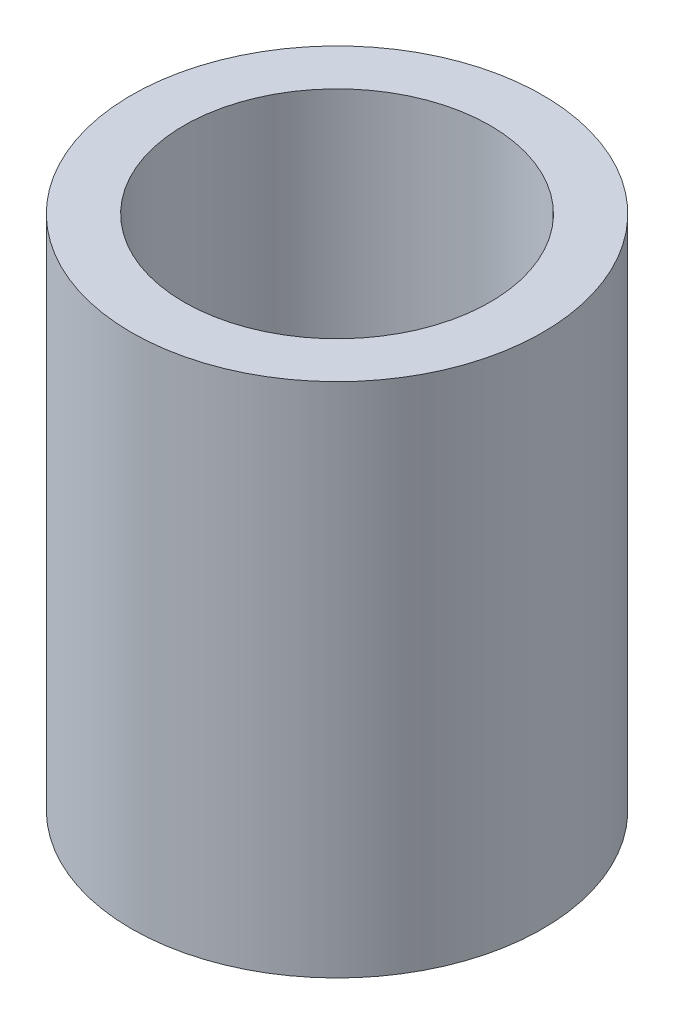
ISO-10303-21;
HEADER;
FILE_DESCRIPTION(('STEP AP214'),'2;1');
FILE_NAME('part.step','',(''),(''),'','','');
FILE_SCHEMA(('AUTOMOTIVE_DESIGN { 1 0 10303 214 1 1 1 1 }'));
ENDSEC;
DATA;
#1=APPLICATION_CONTEXT('core data for automotive mechanical design processes');
#2=APPLICATION_PROTOCOL_DEFINITION('international standard','automotive_design',2000,#1);
#3=PRODUCT_CONTEXT('',#1,'mechanical');
#4=PRODUCT('Part','Part','',(#3));
#5=PRODUCT_RELATED_PRODUCT_CATEGORY('part','',(#4));
#6=PRODUCT_DEFINITION_FORMATION('','',#4);
#7=PRODUCT_DEFINITION_CONTEXT('part definition',#1,'design');
#8=PRODUCT_DEFINITION('design','',#6,#7);
#9=PRODUCT_DEFINITION_SHAPE('','',#8);
#10=(LENGTH_UNIT() NAMED_UNIT(*) SI_UNIT(.MILLI.,.METRE.));
#11=(NAMED_UNIT(*) PLANE_ANGLE_UNIT() SI_UNIT($,.RADIAN.));
#12=(NAMED_UNIT(*) SI_UNIT($,.STERADIAN.) SOLID_ANGLE_UNIT());
#13=UNCERTAINTY_MEASURE_WITH_UNIT(LENGTH_MEASURE(1.E-05),#10,'distance_accuracy_value','');
#14=(GEOMETRIC_REPRESENTATION_CONTEXT(3) GLOBAL_UNCERTAINTY_ASSIGNED_CONTEXT((#13)) GLOBAL_UNIT_ASSIGNED_CONTEXT((#10,
#11,#12)) REPRESENTATION_CONTEXT('',''));
#15=CARTESIAN_POINT('',(0.,0.,0.));
#16=DIRECTION('',(0.,0.,1.));
#17=DIRECTION('',(1.,0.,0.));
#18=AXIS2_PLACEMENT_3D('',#15,#16,#17);
#19=CARTESIAN_POINT('',(0.,75.3548984478074,0.));
#20=DIRECTION('',(0.,-1.,0.));
#21=DIRECTION('',(0.,0.,-1.));
#22=AXIS2_PLACEMENT_3D('',#19,#20,#21);
#23=CYLINDRICAL_SURFACE('',#22,30.);
#24=CARTESIAN_POINT('',(0.,75.3548984478074,0.));
#25=DIRECTION('',(0.,1.,0.));
#26=DIRECTION('',(0.,0.,1.));
#27=AXIS2_PLACEMENT_3D('',#24,#25,#26);
#28=CIRCLE('',#27,30.);
#29=CARTESIAN_POINT('',(0.,75.3548984478074,30.));
#30=VERTEX_POINT('',#29);
#31=EDGE_CURVE('E10',#30,#30,#28,.T.);
#32=ORIENTED_EDGE('',*,*,#31,.F.);
#33=EDGE_LOOP('',(#32));
#34=FACE_BOUND('',#33,.T.);
#35=CARTESIAN_POINT('',(0.,0.,0.));
#36=DIRECTION('',(0.,1.,0.));
#37=DIRECTION('',(0.,0.,1.));
#38=AXIS2_PLACEMENT_3D('',#35,#36,#37);
#39=CIRCLE('',#38,30.);
#40=CARTESIAN_POINT('',(0.,0.,30.));
#41=VERTEX_POINT('',#40);
#42=EDGE_CURVE('E37',#41,#41,#39,.T.);
#43=ORIENTED_EDGE('',*,*,#42,.T.);
#44=EDGE_LOOP('',(#43));
#45=FACE_BOUND('',#44,.T.);
#46=ADVANCED_FACE('F40',(#34,#45),#23,.T.);
#47=CARTESIAN_POINT('',(0.,75.3548984478074,0.));
#48=DIRECTION('',(0.,1.,0.));
#49=DIRECTION('',(0.,0.,1.));
#50=AXIS2_PLACEMENT_3D('',#47,#48,#49);
#51=PLANE('',#50);
#52=CARTESIAN_POINT('',(0.,75.3548984478074,0.));
#53=DIRECTION('',(0.,1.,0.));
#54=DIRECTION('',(0.,0.,1.));
#55=AXIS2_PLACEMENT_3D('',#52,#53,#54);
#56=CIRCLE('',#55,22.3321257532519);
#57=CARTESIAN_POINT('',(0.,75.3548984478074,22.3321257532519));
#58=VERTEX_POINT('',#57);
#59=EDGE_CURVE('E50',#58,#58,#56,.T.);
#60=ORIENTED_EDGE('',*,*,#59,.F.);
#61=EDGE_LOOP('',(#60));
#62=FACE_BOUND('',#61,.T.);
#63=ORIENTED_EDGE('',*,*,#31,.T.);
#64=EDGE_LOOP('',(#63));
#65=FACE_BOUND('',#64,.T.);
#66=ADVANCED_FACE('F59',(#62,#65),#51,.T.);
#67=CARTESIAN_POINT('',(0.,0.,0.));
#68=DIRECTION('',(0.,1.,0.));
#69=DIRECTION('',(0.,0.,1.));
#70=AXIS2_PLACEMENT_3D('',#67,#68,#69);
#71=PLANE('',#70);
#72=CARTESIAN_POINT('',(0.,0.,0.));
#73=DIRECTION('',(0.,1.,0.));
#74=DIRECTION('',(0.,0.,1.));
#75=AXIS2_PLACEMENT_3D('',#72,#73,#74);
#76=CIRCLE('',#75,22.3321257532519);
#77=CARTESIAN_POINT('',(0.,0.,22.3321257532519));
#78=VERTEX_POINT('',#77);
#79=EDGE_CURVE('E47',#78,#78,#76,.T.);
#80=ORIENTED_EDGE('',*,*,#79,.T.);
#81=EDGE_LOOP('',(#80));
#82=FACE_BOUND('',#81,.T.);
#83=ORIENTED_EDGE('',*,*,#42,.F.);
#84=EDGE_LOOP('',(#83));
#85=FACE_BOUND('',#84,.T.);
#86=ADVANCED_FACE('F58',(#82,#85),#71,.F.);
#87=CARTESIAN_POINT('',(0.,75.3548984478074,0.));
#88=DIRECTION('',(0.,-1.,0.));
#89=DIRECTION('',(0.,0.,-1.));
#90=AXIS2_PLACEMENT_3D('',#87,#88,#89);
#91=CYLINDRICAL_SURFACE('',#90,22.3321257532519);
#92=ORIENTED_EDGE('',*,*,#59,.T.);
#93=EDGE_LOOP('',(#92));
#94=FACE_BOUND('',#93,.T.);
#95=ORIENTED_EDGE('',*,*,#79,.F.);
#96=EDGE_LOOP('',(#95));
#97=FACE_BOUND('',#96,.T.);
#98=ADVANCED_FACE('F54',(#94,#97),#91,.F.);
#99=CLOSED_SHELL('',(#46,#66,#86,#98));
#100=MANIFOLD_SOLID_BREP('B2',#99);
#101=ADVANCED_BREP_SHAPE_REPRESENTATION('',(#18,#100),#14);
#102=SHAPE_DEFINITION_REPRESENTATION(#9,#101);
ENDSEC;
END-ISO-10303-21;
